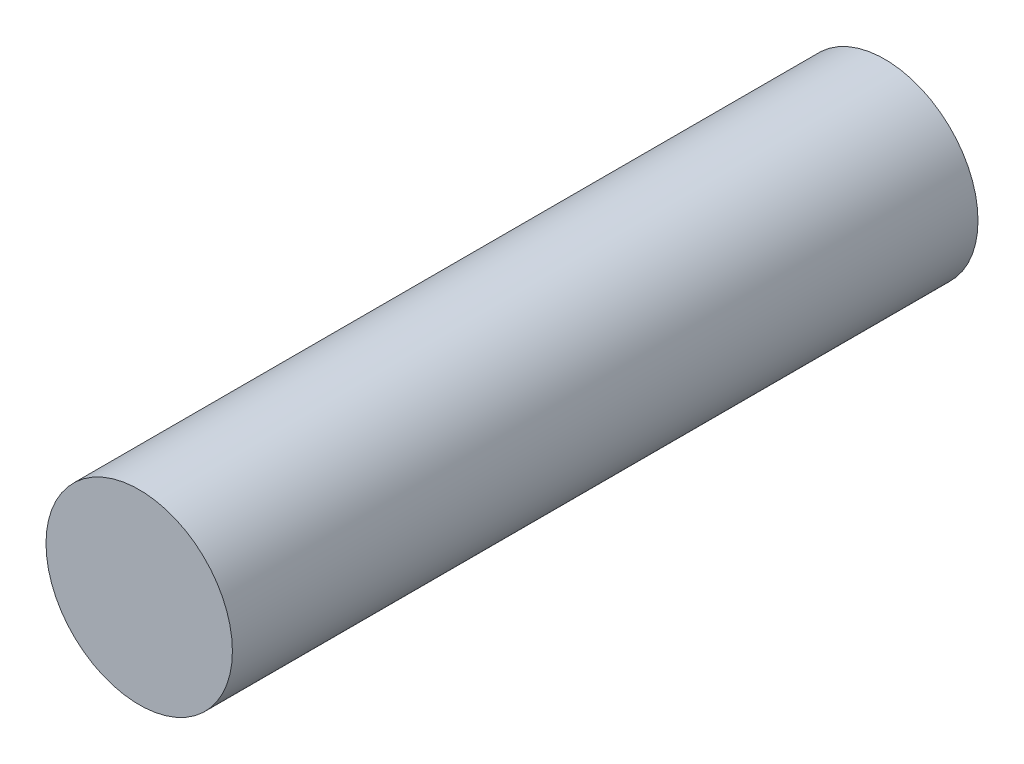
ISO-10303-21;
HEADER;
FILE_DESCRIPTION(('STEP AP214'),'2;1');
FILE_NAME('part.step','',(''),(''),'','','');
FILE_SCHEMA(('AUTOMOTIVE_DESIGN { 1 0 10303 214 1 1 1 1 }'));
ENDSEC;
DATA;
#1=APPLICATION_CONTEXT('core data for automotive mechanical design processes');
#2=APPLICATION_PROTOCOL_DEFINITION('international standard','automotive_design',2000,#1);
#3=PRODUCT_CONTEXT('',#1,'mechanical');
#4=PRODUCT('Part','Part','',(#3));
#5=PRODUCT_RELATED_PRODUCT_CATEGORY('part','',(#4));
#6=PRODUCT_DEFINITION_FORMATION('','',#4);
#7=PRODUCT_DEFINITION_CONTEXT('part definition',#1,'design');
#8=PRODUCT_DEFINITION('design','',#6,#7);
#9=PRODUCT_DEFINITION_SHAPE('','',#8);
#10=(LENGTH_UNIT() NAMED_UNIT(*) SI_UNIT(.MILLI.,.METRE.));
#11=(NAMED_UNIT(*) PLANE_ANGLE_UNIT() SI_UNIT($,.RADIAN.));
#12=(NAMED_UNIT(*) SI_UNIT($,.STERADIAN.) SOLID_ANGLE_UNIT());
#13=UNCERTAINTY_MEASURE_WITH_UNIT(LENGTH_MEASURE(1.E-05),#10,'distance_accuracy_value','');
#14=(GEOMETRIC_REPRESENTATION_CONTEXT(3) GLOBAL_UNCERTAINTY_ASSIGNED_CONTEXT((#13)) GLOBAL_UNIT_ASSIGNED_CONTEXT((#10,
#11,#12)) REPRESENTATION_CONTEXT('',''));
#15=CARTESIAN_POINT('',(0.,0.,0.));
#16=DIRECTION('',(0.,0.,1.));
#17=DIRECTION('',(1.,0.,0.));
#18=AXIS2_PLACEMENT_3D('',#15,#16,#17);
#19=CARTESIAN_POINT('',(0.,0.,40.));
#20=DIRECTION('',(0.,0.,-1.));
#21=DIRECTION('',(-1.,0.,0.));
#22=AXIS2_PLACEMENT_3D('',#19,#20,#21);
#23=CYLINDRICAL_SURFACE('',#22,5.);
#24=CARTESIAN_POINT('',(0.,0.,40.));
#25=DIRECTION('',(0.,0.,1.));
#26=DIRECTION('',(1.,0.,0.));
#27=AXIS2_PLACEMENT_3D('',#24,#25,#26);
#28=CIRCLE('',#27,5.);
#29=CARTESIAN_POINT('',(5.,0.,40.));
#30=VERTEX_POINT('',#29);
#31=EDGE_CURVE('E10',#30,#30,#28,.T.);
#32=ORIENTED_EDGE('',*,*,#31,.F.);
#33=EDGE_LOOP('',(#32));
#34=FACE_BOUND('',#33,.T.);
#35=CARTESIAN_POINT('',(0.,0.,0.));
#36=DIRECTION('',(0.,0.,1.));
#37=DIRECTION('',(1.,0.,0.));
#38=AXIS2_PLACEMENT_3D('',#35,#36,#37);
#39=CIRCLE('',#38,5.);
#40=CARTESIAN_POINT('',(5.,0.,0.));
#41=VERTEX_POINT('',#40);
#42=EDGE_CURVE('E40',#41,#41,#39,.T.);
#43=ORIENTED_EDGE('',*,*,#42,.T.);
#44=EDGE_LOOP('',(#43));
#45=FACE_BOUND('',#44,.T.);
#46=ADVANCED_FACE('F37',(#34,#45),#23,.T.);
#47=CARTESIAN_POINT('',(0.,0.,40.));
#48=DIRECTION('',(0.,0.,1.));
#49=DIRECTION('',(1.,0.,0.));
#50=AXIS2_PLACEMENT_3D('',#47,#48,#49);
#51=PLANE('',#50);
#52=ORIENTED_EDGE('',*,*,#31,.T.);
#53=EDGE_LOOP('',(#52));
#54=FACE_BOUND('',#53,.T.);
#55=ADVANCED_FACE('F54',(#54),#51,.T.);
#56=CARTESIAN_POINT('',(0.,0.,0.));
#57=DIRECTION('',(0.,0.,1.));
#58=DIRECTION('',(1.,0.,0.));
#59=AXIS2_PLACEMENT_3D('',#56,#57,#58);
#60=PLANE('',#59);
#61=ORIENTED_EDGE('',*,*,#42,.F.);
#62=EDGE_LOOP('',(#61));
#63=FACE_BOUND('',#62,.T.);
#64=ADVANCED_FACE('F52',(#63),#60,.F.);
#65=CLOSED_SHELL('',(#46,#55,#64));
#66=MANIFOLD_SOLID_BREP('B2',#65);
#67=ADVANCED_BREP_SHAPE_REPRESENTATION('',(#18,#66),#14);
#68=SHAPE_DEFINITION_REPRESENTATION(#9,#67);
ENDSEC;
END-ISO-10303-21;
